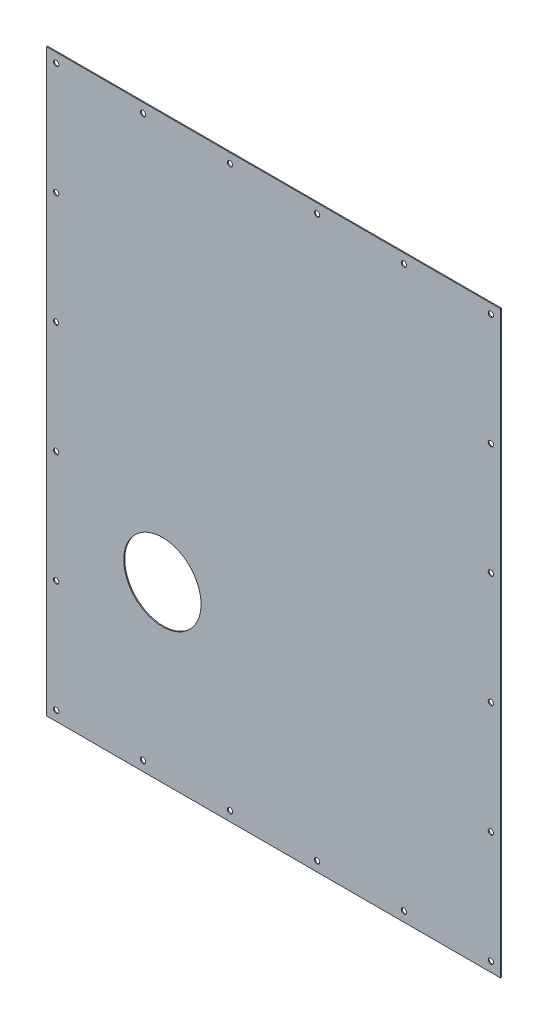
ISO-10303-21;
HEADER;
FILE_DESCRIPTION(('STEP AP214'),'2;1');
FILE_NAME('part.step','',(''),(''),'','','');
FILE_SCHEMA(('AUTOMOTIVE_DESIGN { 1 0 10303 214 1 1 1 1 }'));
ENDSEC;
DATA;
#1=APPLICATION_CONTEXT('core data for automotive mechanical design processes');
#2=APPLICATION_PROTOCOL_DEFINITION('international standard','automotive_design',2000,#1);
#3=PRODUCT_CONTEXT('',#1,'mechanical');
#4=PRODUCT('Part','Part','',(#3));
#5=PRODUCT_RELATED_PRODUCT_CATEGORY('part','',(#4));
#6=PRODUCT_DEFINITION_FORMATION('','',#4);
#7=PRODUCT_DEFINITION_CONTEXT('part definition',#1,'design');
#8=PRODUCT_DEFINITION('design','',#6,#7);
#9=PRODUCT_DEFINITION_SHAPE('','',#8);
#10=(LENGTH_UNIT() NAMED_UNIT(*) SI_UNIT(.MILLI.,.METRE.));
#11=(NAMED_UNIT(*) PLANE_ANGLE_UNIT() SI_UNIT($,.RADIAN.));
#12=(NAMED_UNIT(*) SI_UNIT($,.STERADIAN.) SOLID_ANGLE_UNIT());
#13=UNCERTAINTY_MEASURE_WITH_UNIT(LENGTH_MEASURE(1.E-05),#10,'distance_accuracy_value','');
#14=(GEOMETRIC_REPRESENTATION_CONTEXT(3) GLOBAL_UNCERTAINTY_ASSIGNED_CONTEXT((#13)) GLOBAL_UNIT_ASSIGNED_CONTEXT((#10,
#11,#12)) REPRESENTATION_CONTEXT('',''));
#15=CARTESIAN_POINT('',(0.,0.,0.));
#16=DIRECTION('',(0.,0.,1.));
#17=DIRECTION('',(1.,0.,0.));
#18=AXIS2_PLACEMENT_3D('',#15,#16,#17);
#19=CARTESIAN_POINT('',(-235.,-300.,1.));
#20=DIRECTION('',(-1.,0.,0.));
#21=DIRECTION('',(0.,0.,1.));
#22=AXIS2_PLACEMENT_3D('',#19,#20,#21);
#23=PLANE('',#22);
#24=DIRECTION('',(0.,1.,0.));
#25=VECTOR('',#24,1.);
#26=CARTESIAN_POINT('',(-235.,-300.,0.));
#27=LINE('',#26,#25);
#28=CARTESIAN_POINT('',(-235.,-300.,0.));
#29=VERTEX_POINT('',#28);
#30=CARTESIAN_POINT('',(-235.,300.,0.));
#31=VERTEX_POINT('',#30);
#32=EDGE_CURVE('E103',#29,#31,#27,.T.);
#33=ORIENTED_EDGE('',*,*,#32,.F.);
#34=DIRECTION('',(0.,0.,-1.));
#35=VECTOR('',#34,1.);
#36=CARTESIAN_POINT('',(-235.,-300.,1.));
#37=LINE('',#36,#35);
#38=CARTESIAN_POINT('',(-235.,-300.,1.));
#39=VERTEX_POINT('',#38);
#40=EDGE_CURVE('E11',#39,#29,#37,.T.);
#41=ORIENTED_EDGE('',*,*,#40,.F.);
#42=DIRECTION('',(0.,1.,0.));
#43=VECTOR('',#42,1.);
#44=CARTESIAN_POINT('',(-235.,-300.,1.));
#45=LINE('',#44,#43);
#46=CARTESIAN_POINT('',(-235.,300.,1.));
#47=VERTEX_POINT('',#46);
#48=EDGE_CURVE('E97',#39,#47,#45,.T.);
#49=ORIENTED_EDGE('',*,*,#48,.T.);
#50=DIRECTION('',(0.,0.,-1.));
#51=VECTOR('',#50,1.);
#52=CARTESIAN_POINT('',(-235.,300.,1.));
#53=LINE('',#52,#51);
#54=EDGE_CURVE('E40',#47,#31,#53,.T.);
#55=ORIENTED_EDGE('',*,*,#54,.T.);
#56=EDGE_LOOP('',(#33,#41,#49,#55));
#57=FACE_BOUND('',#56,.T.);
#58=ADVANCED_FACE('F37',(#57),#23,.T.);
#59=CARTESIAN_POINT('',(-235.,-300.,1.));
#60=DIRECTION('',(0.,1.,0.));
#61=DIRECTION('',(0.,0.,1.));
#62=AXIS2_PLACEMENT_3D('',#59,#60,#61);
#63=PLANE('',#62);
#64=DIRECTION('',(1.,0.,0.));
#65=VECTOR('',#64,1.);
#66=CARTESIAN_POINT('',(-235.,-300.,0.));
#67=LINE('',#66,#65);
#68=CARTESIAN_POINT('',(235.,-300.,0.));
#69=VERTEX_POINT('',#68);
#70=EDGE_CURVE('E70',#29,#69,#67,.T.);
#71=ORIENTED_EDGE('',*,*,#70,.T.);
#72=DIRECTION('',(0.,0.,-1.));
#73=VECTOR('',#72,1.);
#74=CARTESIAN_POINT('',(235.,-300.,1.));
#75=LINE('',#74,#73);
#76=CARTESIAN_POINT('',(235.,-300.,1.));
#77=VERTEX_POINT('',#76);
#78=EDGE_CURVE('E46',#77,#69,#75,.T.);
#79=ORIENTED_EDGE('',*,*,#78,.F.);
#80=DIRECTION('',(1.,0.,0.));
#81=VECTOR('',#80,1.);
#82=CARTESIAN_POINT('',(-235.,-300.,1.));
#83=LINE('',#82,#81);
#84=EDGE_CURVE('E87',#39,#77,#83,.T.);
#85=ORIENTED_EDGE('',*,*,#84,.F.);
#86=ORIENTED_EDGE('',*,*,#40,.T.);
#87=EDGE_LOOP('',(#71,#79,#85,#86));
#88=FACE_BOUND('',#87,.T.);
#89=ADVANCED_FACE('F114',(#88),#63,.F.);
#90=CARTESIAN_POINT('',(235.,-300.,1.));
#91=DIRECTION('',(-1.,0.,0.));
#92=DIRECTION('',(0.,0.,1.));
#93=AXIS2_PLACEMENT_3D('',#90,#91,#92);
#94=PLANE('',#93);
#95=DIRECTION('',(0.,1.,0.));
#96=VECTOR('',#95,1.);
#97=CARTESIAN_POINT('',(235.,-300.,0.));
#98=LINE('',#97,#96);
#99=CARTESIAN_POINT('',(235.,300.,0.));
#100=VERTEX_POINT('',#99);
#101=EDGE_CURVE('E94',#69,#100,#98,.T.);
#102=ORIENTED_EDGE('',*,*,#101,.T.);
#103=DIRECTION('',(0.,0.,-1.));
#104=VECTOR('',#103,1.);
#105=CARTESIAN_POINT('',(235.,300.,1.));
#106=LINE('',#105,#104);
#107=CARTESIAN_POINT('',(235.,300.,1.));
#108=VERTEX_POINT('',#107);
#109=EDGE_CURVE('E91',#108,#100,#106,.T.);
#110=ORIENTED_EDGE('',*,*,#109,.F.);
#111=DIRECTION('',(0.,1.,0.));
#112=VECTOR('',#111,1.);
#113=CARTESIAN_POINT('',(235.,-300.,1.));
#114=LINE('',#113,#112);
#115=EDGE_CURVE('E82',#77,#108,#114,.T.);
#116=ORIENTED_EDGE('',*,*,#115,.F.);
#117=ORIENTED_EDGE('',*,*,#78,.T.);
#118=EDGE_LOOP('',(#102,#110,#116,#117));
#119=FACE_BOUND('',#118,.T.);
#120=ADVANCED_FACE('F92',(#119),#94,.F.);
#121=CARTESIAN_POINT('',(-235.,300.,1.));
#122=DIRECTION('',(0.,1.,0.));
#123=DIRECTION('',(0.,0.,1.));
#124=AXIS2_PLACEMENT_3D('',#121,#122,#123);
#125=PLANE('',#124);
#126=DIRECTION('',(1.,0.,0.));
#127=VECTOR('',#126,1.);
#128=CARTESIAN_POINT('',(-235.,300.,0.));
#129=LINE('',#128,#127);
#130=EDGE_CURVE('E106',#31,#100,#129,.T.);
#131=ORIENTED_EDGE('',*,*,#130,.F.);
#132=ORIENTED_EDGE('',*,*,#54,.F.);
#133=DIRECTION('',(1.,0.,0.));
#134=VECTOR('',#133,1.);
#135=CARTESIAN_POINT('',(-235.,300.,1.));
#136=LINE('',#135,#134);
#137=EDGE_CURVE('E86',#47,#108,#136,.T.);
#138=ORIENTED_EDGE('',*,*,#137,.T.);
#139=ORIENTED_EDGE('',*,*,#109,.T.);
#140=EDGE_LOOP('',(#131,#132,#138,#139));
#141=FACE_BOUND('',#140,.T.);
#142=ADVANCED_FACE('F96',(#141),#125,.T.);
#143=CARTESIAN_POINT('',(0.,0.,1.));
#144=DIRECTION('',(0.,0.,-1.));
#145=DIRECTION('',(-1.,0.,0.));
#146=AXIS2_PLACEMENT_3D('',#143,#144,#145);
#147=PLANE('',#146);
#148=CARTESIAN_POINT('',(-115.,-120.,0.999999999999999));
#149=DIRECTION('',(0.,0.,-1.));
#150=DIRECTION('',(-1.,0.,0.));
#151=AXIS2_PLACEMENT_3D('',#148,#149,#150);
#152=CIRCLE('',#151,40.);
#153=CARTESIAN_POINT('',(-155.,-120.,0.999999999999999));
#154=VERTEX_POINT('',#153);
#155=EDGE_CURVE('E227',#154,#154,#152,.T.);
#156=ORIENTED_EDGE('',*,*,#155,.T.);
#157=EDGE_LOOP('',(#156));
#158=FACE_BOUND('',#157,.T.);
#159=CARTESIAN_POINT('',(225.,290.,1.));
#160=DIRECTION('',(0.,0.,-1.));
#161=DIRECTION('',(-1.,0.,0.));
#162=AXIS2_PLACEMENT_3D('',#159,#160,#161);
#163=CIRCLE('',#162,2.75);
#164=CARTESIAN_POINT('',(222.25,290.,1.));
#165=VERTEX_POINT('',#164);
#166=EDGE_CURVE('E231',#165,#165,#163,.T.);
#167=ORIENTED_EDGE('',*,*,#166,.T.);
#168=EDGE_LOOP('',(#167));
#169=FACE_BOUND('',#168,.T.);
#170=CARTESIAN_POINT('',(135.,290.,1.));
#171=DIRECTION('',(0.,0.,-1.));
#172=DIRECTION('',(-1.,0.,0.));
#173=AXIS2_PLACEMENT_3D('',#170,#171,#172);
#174=CIRCLE('',#173,2.75);
#175=CARTESIAN_POINT('',(132.25,290.,1.));
#176=VERTEX_POINT('',#175);
#177=EDGE_CURVE('E240',#176,#176,#174,.T.);
#178=ORIENTED_EDGE('',*,*,#177,.T.);
#179=EDGE_LOOP('',(#178));
#180=FACE_BOUND('',#179,.T.);
#181=CARTESIAN_POINT('',(45.,290.,1.));
#182=DIRECTION('',(0.,0.,-1.));
#183=DIRECTION('',(-1.,0.,0.));
#184=AXIS2_PLACEMENT_3D('',#181,#182,#183);
#185=CIRCLE('',#184,2.75);
#186=CARTESIAN_POINT('',(42.25,290.,1.));
#187=VERTEX_POINT('',#186);
#188=EDGE_CURVE('E246',#187,#187,#185,.T.);
#189=ORIENTED_EDGE('',*,*,#188,.T.);
#190=EDGE_LOOP('',(#189));
#191=FACE_BOUND('',#190,.T.);
#192=CARTESIAN_POINT('',(-45.,290.,1.));
#193=DIRECTION('',(0.,0.,-1.));
#194=DIRECTION('',(-1.,0.,0.));
#195=AXIS2_PLACEMENT_3D('',#192,#193,#194);
#196=CIRCLE('',#195,2.75);
#197=CARTESIAN_POINT('',(-47.75,290.,1.));
#198=VERTEX_POINT('',#197);
#199=EDGE_CURVE('E252',#198,#198,#196,.T.);
#200=ORIENTED_EDGE('',*,*,#199,.T.);
#201=EDGE_LOOP('',(#200));
#202=FACE_BOUND('',#201,.T.);
#203=CARTESIAN_POINT('',(-135.,290.,1.));
#204=DIRECTION('',(0.,0.,-1.));
#205=DIRECTION('',(-1.,0.,0.));
#206=AXIS2_PLACEMENT_3D('',#203,#204,#205);
#207=CIRCLE('',#206,2.75);
#208=CARTESIAN_POINT('',(-137.75,290.,1.));
#209=VERTEX_POINT('',#208);
#210=EDGE_CURVE('E258',#209,#209,#207,.T.);
#211=ORIENTED_EDGE('',*,*,#210,.T.);
#212=EDGE_LOOP('',(#211));
#213=FACE_BOUND('',#212,.T.);
#214=CARTESIAN_POINT('',(-225.,290.,1.));
#215=DIRECTION('',(0.,0.,-1.));
#216=DIRECTION('',(-1.,0.,0.));
#217=AXIS2_PLACEMENT_3D('',#214,#215,#216);
#218=CIRCLE('',#217,2.75);
#219=CARTESIAN_POINT('',(-227.75,290.,1.));
#220=VERTEX_POINT('',#219);
#221=EDGE_CURVE('E264',#220,#220,#218,.T.);
#222=ORIENTED_EDGE('',*,*,#221,.T.);
#223=EDGE_LOOP('',(#222));
#224=FACE_BOUND('',#223,.T.);
#225=CARTESIAN_POINT('',(-225.,174.,1.));
#226=DIRECTION('',(0.,0.,-1.));
#227=DIRECTION('',(-1.,0.,0.));
#228=AXIS2_PLACEMENT_3D('',#225,#226,#227);
#229=CIRCLE('',#228,2.75);
#230=CARTESIAN_POINT('',(-227.75,174.,1.));
#231=VERTEX_POINT('',#230);
#232=EDGE_CURVE('E270',#231,#231,#229,.T.);
#233=ORIENTED_EDGE('',*,*,#232,.T.);
#234=EDGE_LOOP('',(#233));
#235=FACE_BOUND('',#234,.T.);
#236=CARTESIAN_POINT('',(-225.,57.9999999999999,1.));
#237=DIRECTION('',(0.,0.,-1.));
#238=DIRECTION('',(-1.,0.,0.));
#239=AXIS2_PLACEMENT_3D('',#236,#237,#238);
#240=CIRCLE('',#239,2.75);
#241=CARTESIAN_POINT('',(-227.75,57.9999999999999,1.));
#242=VERTEX_POINT('',#241);
#243=EDGE_CURVE('E276',#242,#242,#240,.T.);
#244=ORIENTED_EDGE('',*,*,#243,.T.);
#245=EDGE_LOOP('',(#244));
#246=FACE_BOUND('',#245,.T.);
#247=CARTESIAN_POINT('',(-225.,-58.0000000000001,1.));
#248=DIRECTION('',(0.,0.,-1.));
#249=DIRECTION('',(-1.,0.,0.));
#250=AXIS2_PLACEMENT_3D('',#247,#248,#249);
#251=CIRCLE('',#250,2.75);
#252=CARTESIAN_POINT('',(-227.75,-58.0000000000001,1.));
#253=VERTEX_POINT('',#252);
#254=EDGE_CURVE('E282',#253,#253,#251,.T.);
#255=ORIENTED_EDGE('',*,*,#254,.T.);
#256=EDGE_LOOP('',(#255));
#257=FACE_BOUND('',#256,.T.);
#258=CARTESIAN_POINT('',(-225.,-174.,1.));
#259=DIRECTION('',(0.,0.,-1.));
#260=DIRECTION('',(-1.,0.,0.));
#261=AXIS2_PLACEMENT_3D('',#258,#259,#260);
#262=CIRCLE('',#261,2.75);
#263=CARTESIAN_POINT('',(-227.75,-174.,1.));
#264=VERTEX_POINT('',#263);
#265=EDGE_CURVE('E288',#264,#264,#262,.T.);
#266=ORIENTED_EDGE('',*,*,#265,.T.);
#267=EDGE_LOOP('',(#266));
#268=FACE_BOUND('',#267,.T.);
#269=CARTESIAN_POINT('',(-225.,-290.,1.));
#270=DIRECTION('',(0.,0.,-1.));
#271=DIRECTION('',(-1.,0.,0.));
#272=AXIS2_PLACEMENT_3D('',#269,#270,#271);
#273=CIRCLE('',#272,2.75);
#274=CARTESIAN_POINT('',(-227.75,-290.,1.));
#275=VERTEX_POINT('',#274);
#276=EDGE_CURVE('E294',#275,#275,#273,.T.);
#277=ORIENTED_EDGE('',*,*,#276,.T.);
#278=EDGE_LOOP('',(#277));
#279=FACE_BOUND('',#278,.T.);
#280=CARTESIAN_POINT('',(225.,174.,1.));
#281=DIRECTION('',(0.,0.,-1.));
#282=DIRECTION('',(-1.,0.,0.));
#283=AXIS2_PLACEMENT_3D('',#280,#281,#282);
#284=CIRCLE('',#283,2.75);
#285=CARTESIAN_POINT('',(222.25,174.,1.));
#286=VERTEX_POINT('',#285);
#287=EDGE_CURVE('E300',#286,#286,#284,.T.);
#288=ORIENTED_EDGE('',*,*,#287,.T.);
#289=EDGE_LOOP('',(#288));
#290=FACE_BOUND('',#289,.T.);
#291=CARTESIAN_POINT('',(225.,57.9999999999999,1.));
#292=DIRECTION('',(0.,0.,-1.));
#293=DIRECTION('',(-1.,0.,0.));
#294=AXIS2_PLACEMENT_3D('',#291,#292,#293);
#295=CIRCLE('',#294,2.75);
#296=CARTESIAN_POINT('',(222.25,57.9999999999999,1.));
#297=VERTEX_POINT('',#296);
#298=EDGE_CURVE('E306',#297,#297,#295,.T.);
#299=ORIENTED_EDGE('',*,*,#298,.T.);
#300=EDGE_LOOP('',(#299));
#301=FACE_BOUND('',#300,.T.);
#302=CARTESIAN_POINT('',(225.,-58.0000000000001,1.));
#303=DIRECTION('',(0.,0.,-1.));
#304=DIRECTION('',(-1.,0.,0.));
#305=AXIS2_PLACEMENT_3D('',#302,#303,#304);
#306=CIRCLE('',#305,2.75);
#307=CARTESIAN_POINT('',(222.25,-58.0000000000001,1.));
#308=VERTEX_POINT('',#307);
#309=EDGE_CURVE('E312',#308,#308,#306,.T.);
#310=ORIENTED_EDGE('',*,*,#309,.T.);
#311=EDGE_LOOP('',(#310));
#312=FACE_BOUND('',#311,.T.);
#313=CARTESIAN_POINT('',(225.,-174.,1.));
#314=DIRECTION('',(0.,0.,-1.));
#315=DIRECTION('',(-1.,0.,0.));
#316=AXIS2_PLACEMENT_3D('',#313,#314,#315);
#317=CIRCLE('',#316,2.75);
#318=CARTESIAN_POINT('',(222.25,-174.,1.));
#319=VERTEX_POINT('',#318);
#320=EDGE_CURVE('E318',#319,#319,#317,.T.);
#321=ORIENTED_EDGE('',*,*,#320,.T.);
#322=EDGE_LOOP('',(#321));
#323=FACE_BOUND('',#322,.T.);
#324=CARTESIAN_POINT('',(225.,-290.,1.));
#325=DIRECTION('',(0.,0.,-1.));
#326=DIRECTION('',(-1.,0.,0.));
#327=AXIS2_PLACEMENT_3D('',#324,#325,#326);
#328=CIRCLE('',#327,2.75);
#329=CARTESIAN_POINT('',(222.25,-290.,1.));
#330=VERTEX_POINT('',#329);
#331=EDGE_CURVE('E324',#330,#330,#328,.T.);
#332=ORIENTED_EDGE('',*,*,#331,.T.);
#333=EDGE_LOOP('',(#332));
#334=FACE_BOUND('',#333,.T.);
#335=CARTESIAN_POINT('',(135.,-290.,1.));
#336=DIRECTION('',(0.,0.,-1.));
#337=DIRECTION('',(-1.,0.,0.));
#338=AXIS2_PLACEMENT_3D('',#335,#336,#337);
#339=CIRCLE('',#338,2.75);
#340=CARTESIAN_POINT('',(132.25,-290.,1.));
#341=VERTEX_POINT('',#340);
#342=EDGE_CURVE('E330',#341,#341,#339,.T.);
#343=ORIENTED_EDGE('',*,*,#342,.T.);
#344=EDGE_LOOP('',(#343));
#345=FACE_BOUND('',#344,.T.);
#346=CARTESIAN_POINT('',(45.,-290.,1.));
#347=DIRECTION('',(0.,0.,-1.));
#348=DIRECTION('',(-1.,0.,0.));
#349=AXIS2_PLACEMENT_3D('',#346,#347,#348);
#350=CIRCLE('',#349,2.75);
#351=CARTESIAN_POINT('',(42.25,-290.,1.));
#352=VERTEX_POINT('',#351);
#353=EDGE_CURVE('E336',#352,#352,#350,.T.);
#354=ORIENTED_EDGE('',*,*,#353,.T.);
#355=EDGE_LOOP('',(#354));
#356=FACE_BOUND('',#355,.T.);
#357=CARTESIAN_POINT('',(-45.,-290.,1.));
#358=DIRECTION('',(0.,0.,-1.));
#359=DIRECTION('',(-1.,0.,0.));
#360=AXIS2_PLACEMENT_3D('',#357,#358,#359);
#361=CIRCLE('',#360,2.75);
#362=CARTESIAN_POINT('',(-47.75,-290.,1.));
#363=VERTEX_POINT('',#362);
#364=EDGE_CURVE('E342',#363,#363,#361,.T.);
#365=ORIENTED_EDGE('',*,*,#364,.T.);
#366=EDGE_LOOP('',(#365));
#367=FACE_BOUND('',#366,.T.);
#368=CARTESIAN_POINT('',(-135.,-290.,1.));
#369=DIRECTION('',(0.,0.,-1.));
#370=DIRECTION('',(-1.,0.,0.));
#371=AXIS2_PLACEMENT_3D('',#368,#369,#370);
#372=CIRCLE('',#371,2.75);
#373=CARTESIAN_POINT('',(-137.75,-290.,1.));
#374=VERTEX_POINT('',#373);
#375=EDGE_CURVE('E107',#374,#374,#372,.T.);
#376=ORIENTED_EDGE('',*,*,#375,.T.);
#377=EDGE_LOOP('',(#376));
#378=FACE_BOUND('',#377,.T.);
#379=ORIENTED_EDGE('',*,*,#48,.F.);
#380=ORIENTED_EDGE('',*,*,#84,.T.);
#381=ORIENTED_EDGE('',*,*,#115,.T.);
#382=ORIENTED_EDGE('',*,*,#137,.F.);
#383=EDGE_LOOP('',(#379,#380,#381,#382));
#384=FACE_BOUND('',#383,.T.);
#385=ADVANCED_FACE('F85',(#158,#169,#180,#191,#202,#213,#224,#235,#246,#257,#268,#279,#290,#301,
#312,#323,#334,#345,#356,#367,#378,#384),#147,.F.);
#386=CARTESIAN_POINT('',(0.,0.,0.));
#387=DIRECTION('',(0.,0.,-1.));
#388=DIRECTION('',(-1.,0.,0.));
#389=AXIS2_PLACEMENT_3D('',#386,#387,#388);
#390=PLANE('',#389);
#391=CARTESIAN_POINT('',(-115.,-120.,0.));
#392=DIRECTION('',(0.,0.,-1.));
#393=DIRECTION('',(-1.,0.,0.));
#394=AXIS2_PLACEMENT_3D('',#391,#392,#393);
#395=CIRCLE('',#394,40.);
#396=CARTESIAN_POINT('',(-155.,-120.,0.));
#397=VERTEX_POINT('',#396);
#398=EDGE_CURVE('E225',#397,#397,#395,.T.);
#399=ORIENTED_EDGE('',*,*,#398,.F.);
#400=EDGE_LOOP('',(#399));
#401=FACE_BOUND('',#400,.T.);
#402=CARTESIAN_POINT('',(225.,290.,0.));
#403=DIRECTION('',(0.,0.,-1.));
#404=DIRECTION('',(-1.,0.,0.));
#405=AXIS2_PLACEMENT_3D('',#402,#403,#404);
#406=CIRCLE('',#405,2.75);
#407=CARTESIAN_POINT('',(222.25,290.,0.));
#408=VERTEX_POINT('',#407);
#409=EDGE_CURVE('E228',#408,#408,#406,.T.);
#410=ORIENTED_EDGE('',*,*,#409,.F.);
#411=EDGE_LOOP('',(#410));
#412=FACE_BOUND('',#411,.T.);
#413=CARTESIAN_POINT('',(135.,290.,0.));
#414=DIRECTION('',(0.,0.,-1.));
#415=DIRECTION('',(-1.,0.,0.));
#416=AXIS2_PLACEMENT_3D('',#413,#414,#415);
#417=CIRCLE('',#416,2.75);
#418=CARTESIAN_POINT('',(132.25,290.,0.));
#419=VERTEX_POINT('',#418);
#420=EDGE_CURVE('E237',#419,#419,#417,.T.);
#421=ORIENTED_EDGE('',*,*,#420,.F.);
#422=EDGE_LOOP('',(#421));
#423=FACE_BOUND('',#422,.T.);
#424=CARTESIAN_POINT('',(45.,290.,0.));
#425=DIRECTION('',(0.,0.,-1.));
#426=DIRECTION('',(-1.,0.,0.));
#427=AXIS2_PLACEMENT_3D('',#424,#425,#426);
#428=CIRCLE('',#427,2.75);
#429=CARTESIAN_POINT('',(42.25,290.,0.));
#430=VERTEX_POINT('',#429);
#431=EDGE_CURVE('E243',#430,#430,#428,.T.);
#432=ORIENTED_EDGE('',*,*,#431,.F.);
#433=EDGE_LOOP('',(#432));
#434=FACE_BOUND('',#433,.T.);
#435=CARTESIAN_POINT('',(-45.,290.,0.));
#436=DIRECTION('',(0.,0.,-1.));
#437=DIRECTION('',(-1.,0.,0.));
#438=AXIS2_PLACEMENT_3D('',#435,#436,#437);
#439=CIRCLE('',#438,2.75);
#440=CARTESIAN_POINT('',(-47.75,290.,0.));
#441=VERTEX_POINT('',#440);
#442=EDGE_CURVE('E249',#441,#441,#439,.T.);
#443=ORIENTED_EDGE('',*,*,#442,.F.);
#444=EDGE_LOOP('',(#443));
#445=FACE_BOUND('',#444,.T.);
#446=CARTESIAN_POINT('',(-135.,290.,0.));
#447=DIRECTION('',(0.,0.,-1.));
#448=DIRECTION('',(-1.,0.,0.));
#449=AXIS2_PLACEMENT_3D('',#446,#447,#448);
#450=CIRCLE('',#449,2.75);
#451=CARTESIAN_POINT('',(-137.75,290.,0.));
#452=VERTEX_POINT('',#451);
#453=EDGE_CURVE('E255',#452,#452,#450,.T.);
#454=ORIENTED_EDGE('',*,*,#453,.F.);
#455=EDGE_LOOP('',(#454));
#456=FACE_BOUND('',#455,.T.);
#457=CARTESIAN_POINT('',(-225.,290.,0.));
#458=DIRECTION('',(0.,0.,-1.));
#459=DIRECTION('',(-1.,0.,0.));
#460=AXIS2_PLACEMENT_3D('',#457,#458,#459);
#461=CIRCLE('',#460,2.75);
#462=CARTESIAN_POINT('',(-227.75,290.,0.));
#463=VERTEX_POINT('',#462);
#464=EDGE_CURVE('E261',#463,#463,#461,.T.);
#465=ORIENTED_EDGE('',*,*,#464,.F.);
#466=EDGE_LOOP('',(#465));
#467=FACE_BOUND('',#466,.T.);
#468=CARTESIAN_POINT('',(-225.,174.,0.));
#469=DIRECTION('',(0.,0.,-1.));
#470=DIRECTION('',(-1.,0.,0.));
#471=AXIS2_PLACEMENT_3D('',#468,#469,#470);
#472=CIRCLE('',#471,2.75);
#473=CARTESIAN_POINT('',(-227.75,174.,0.));
#474=VERTEX_POINT('',#473);
#475=EDGE_CURVE('E267',#474,#474,#472,.T.);
#476=ORIENTED_EDGE('',*,*,#475,.F.);
#477=EDGE_LOOP('',(#476));
#478=FACE_BOUND('',#477,.T.);
#479=CARTESIAN_POINT('',(-225.,57.9999999999999,0.));
#480=DIRECTION('',(0.,0.,-1.));
#481=DIRECTION('',(-1.,0.,0.));
#482=AXIS2_PLACEMENT_3D('',#479,#480,#481);
#483=CIRCLE('',#482,2.75);
#484=CARTESIAN_POINT('',(-227.75,57.9999999999999,0.));
#485=VERTEX_POINT('',#484);
#486=EDGE_CURVE('E273',#485,#485,#483,.T.);
#487=ORIENTED_EDGE('',*,*,#486,.F.);
#488=EDGE_LOOP('',(#487));
#489=FACE_BOUND('',#488,.T.);
#490=CARTESIAN_POINT('',(-225.,-58.0000000000001,0.));
#491=DIRECTION('',(0.,0.,-1.));
#492=DIRECTION('',(-1.,0.,0.));
#493=AXIS2_PLACEMENT_3D('',#490,#491,#492);
#494=CIRCLE('',#493,2.75);
#495=CARTESIAN_POINT('',(-227.75,-58.0000000000001,0.));
#496=VERTEX_POINT('',#495);
#497=EDGE_CURVE('E279',#496,#496,#494,.T.);
#498=ORIENTED_EDGE('',*,*,#497,.F.);
#499=EDGE_LOOP('',(#498));
#500=FACE_BOUND('',#499,.T.);
#501=CARTESIAN_POINT('',(-225.,-174.,0.));
#502=DIRECTION('',(0.,0.,-1.));
#503=DIRECTION('',(-1.,0.,0.));
#504=AXIS2_PLACEMENT_3D('',#501,#502,#503);
#505=CIRCLE('',#504,2.75);
#506=CARTESIAN_POINT('',(-227.75,-174.,0.));
#507=VERTEX_POINT('',#506);
#508=EDGE_CURVE('E285',#507,#507,#505,.T.);
#509=ORIENTED_EDGE('',*,*,#508,.F.);
#510=EDGE_LOOP('',(#509));
#511=FACE_BOUND('',#510,.T.);
#512=CARTESIAN_POINT('',(-225.,-290.,0.));
#513=DIRECTION('',(0.,0.,-1.));
#514=DIRECTION('',(-1.,0.,0.));
#515=AXIS2_PLACEMENT_3D('',#512,#513,#514);
#516=CIRCLE('',#515,2.75);
#517=CARTESIAN_POINT('',(-227.75,-290.,0.));
#518=VERTEX_POINT('',#517);
#519=EDGE_CURVE('E291',#518,#518,#516,.T.);
#520=ORIENTED_EDGE('',*,*,#519,.F.);
#521=EDGE_LOOP('',(#520));
#522=FACE_BOUND('',#521,.T.);
#523=CARTESIAN_POINT('',(225.,174.,0.));
#524=DIRECTION('',(0.,0.,-1.));
#525=DIRECTION('',(-1.,0.,0.));
#526=AXIS2_PLACEMENT_3D('',#523,#524,#525);
#527=CIRCLE('',#526,2.75);
#528=CARTESIAN_POINT('',(222.25,174.,0.));
#529=VERTEX_POINT('',#528);
#530=EDGE_CURVE('E297',#529,#529,#527,.T.);
#531=ORIENTED_EDGE('',*,*,#530,.F.);
#532=EDGE_LOOP('',(#531));
#533=FACE_BOUND('',#532,.T.);
#534=CARTESIAN_POINT('',(225.,57.9999999999999,0.));
#535=DIRECTION('',(0.,0.,-1.));
#536=DIRECTION('',(-1.,0.,0.));
#537=AXIS2_PLACEMENT_3D('',#534,#535,#536);
#538=CIRCLE('',#537,2.75);
#539=CARTESIAN_POINT('',(222.25,57.9999999999999,0.));
#540=VERTEX_POINT('',#539);
#541=EDGE_CURVE('E303',#540,#540,#538,.T.);
#542=ORIENTED_EDGE('',*,*,#541,.F.);
#543=EDGE_LOOP('',(#542));
#544=FACE_BOUND('',#543,.T.);
#545=CARTESIAN_POINT('',(225.,-58.0000000000001,0.));
#546=DIRECTION('',(0.,0.,-1.));
#547=DIRECTION('',(-1.,0.,0.));
#548=AXIS2_PLACEMENT_3D('',#545,#546,#547);
#549=CIRCLE('',#548,2.75);
#550=CARTESIAN_POINT('',(222.25,-58.0000000000001,0.));
#551=VERTEX_POINT('',#550);
#552=EDGE_CURVE('E309',#551,#551,#549,.T.);
#553=ORIENTED_EDGE('',*,*,#552,.F.);
#554=EDGE_LOOP('',(#553));
#555=FACE_BOUND('',#554,.T.);
#556=CARTESIAN_POINT('',(225.,-174.,0.));
#557=DIRECTION('',(0.,0.,-1.));
#558=DIRECTION('',(-1.,0.,0.));
#559=AXIS2_PLACEMENT_3D('',#556,#557,#558);
#560=CIRCLE('',#559,2.75);
#561=CARTESIAN_POINT('',(222.25,-174.,0.));
#562=VERTEX_POINT('',#561);
#563=EDGE_CURVE('E315',#562,#562,#560,.T.);
#564=ORIENTED_EDGE('',*,*,#563,.F.);
#565=EDGE_LOOP('',(#564));
#566=FACE_BOUND('',#565,.T.);
#567=CARTESIAN_POINT('',(225.,-290.,0.));
#568=DIRECTION('',(0.,0.,-1.));
#569=DIRECTION('',(-1.,0.,0.));
#570=AXIS2_PLACEMENT_3D('',#567,#568,#569);
#571=CIRCLE('',#570,2.75);
#572=CARTESIAN_POINT('',(222.25,-290.,0.));
#573=VERTEX_POINT('',#572);
#574=EDGE_CURVE('E321',#573,#573,#571,.T.);
#575=ORIENTED_EDGE('',*,*,#574,.F.);
#576=EDGE_LOOP('',(#575));
#577=FACE_BOUND('',#576,.T.);
#578=CARTESIAN_POINT('',(135.,-290.,0.));
#579=DIRECTION('',(0.,0.,-1.));
#580=DIRECTION('',(-1.,0.,0.));
#581=AXIS2_PLACEMENT_3D('',#578,#579,#580);
#582=CIRCLE('',#581,2.75);
#583=CARTESIAN_POINT('',(132.25,-290.,0.));
#584=VERTEX_POINT('',#583);
#585=EDGE_CURVE('E327',#584,#584,#582,.T.);
#586=ORIENTED_EDGE('',*,*,#585,.F.);
#587=EDGE_LOOP('',(#586));
#588=FACE_BOUND('',#587,.T.);
#589=CARTESIAN_POINT('',(45.,-290.,0.));
#590=DIRECTION('',(0.,0.,-1.));
#591=DIRECTION('',(-1.,0.,0.));
#592=AXIS2_PLACEMENT_3D('',#589,#590,#591);
#593=CIRCLE('',#592,2.75);
#594=CARTESIAN_POINT('',(42.25,-290.,0.));
#595=VERTEX_POINT('',#594);
#596=EDGE_CURVE('E333',#595,#595,#593,.T.);
#597=ORIENTED_EDGE('',*,*,#596,.F.);
#598=EDGE_LOOP('',(#597));
#599=FACE_BOUND('',#598,.T.);
#600=CARTESIAN_POINT('',(-45.,-290.,0.));
#601=DIRECTION('',(0.,0.,-1.));
#602=DIRECTION('',(-1.,0.,0.));
#603=AXIS2_PLACEMENT_3D('',#600,#601,#602);
#604=CIRCLE('',#603,2.75);
#605=CARTESIAN_POINT('',(-47.75,-290.,0.));
#606=VERTEX_POINT('',#605);
#607=EDGE_CURVE('E339',#606,#606,#604,.T.);
#608=ORIENTED_EDGE('',*,*,#607,.F.);
#609=EDGE_LOOP('',(#608));
#610=FACE_BOUND('',#609,.T.);
#611=CARTESIAN_POINT('',(-135.,-290.,0.));
#612=DIRECTION('',(0.,0.,-1.));
#613=DIRECTION('',(-1.,0.,0.));
#614=AXIS2_PLACEMENT_3D('',#611,#612,#613);
#615=CIRCLE('',#614,2.75);
#616=CARTESIAN_POINT('',(-137.75,-290.,0.));
#617=VERTEX_POINT('',#616);
#618=EDGE_CURVE('E345',#617,#617,#615,.T.);
#619=ORIENTED_EDGE('',*,*,#618,.F.);
#620=EDGE_LOOP('',(#619));
#621=FACE_BOUND('',#620,.T.);
#622=ORIENTED_EDGE('',*,*,#32,.T.);
#623=ORIENTED_EDGE('',*,*,#130,.T.);
#624=ORIENTED_EDGE('',*,*,#101,.F.);
#625=ORIENTED_EDGE('',*,*,#70,.F.);
#626=EDGE_LOOP('',(#622,#623,#624,#625));
#627=FACE_BOUND('',#626,.T.);
#628=ADVANCED_FACE('F112',(#401,#412,#423,#434,#445,#456,#467,#478,#489,#500,#511,#522,#533,
#544,#555,#566,#577,#588,#599,#610,#621,#627),#390,.T.);
#629=CARTESIAN_POINT('',(-135.,-290.,0.));
#630=DIRECTION('',(0.,0.,-1.));
#631=DIRECTION('',(-1.,0.,0.));
#632=AXIS2_PLACEMENT_3D('',#629,#630,#631);
#633=CYLINDRICAL_SURFACE('',#632,2.75);
#634=ORIENTED_EDGE('',*,*,#375,.F.);
#635=EDGE_LOOP('',(#634));
#636=FACE_BOUND('',#635,.T.);
#637=ORIENTED_EDGE('',*,*,#618,.T.);
#638=EDGE_LOOP('',(#637));
#639=FACE_BOUND('',#638,.T.);
#640=ADVANCED_FACE('F133',(#636,#639),#633,.F.);
#641=CARTESIAN_POINT('',(-45.,-290.,0.));
#642=DIRECTION('',(0.,0.,-1.));
#643=DIRECTION('',(-1.,0.,0.));
#644=AXIS2_PLACEMENT_3D('',#641,#642,#643);
#645=CYLINDRICAL_SURFACE('',#644,2.75);
#646=ORIENTED_EDGE('',*,*,#364,.F.);
#647=EDGE_LOOP('',(#646));
#648=FACE_BOUND('',#647,.T.);
#649=ORIENTED_EDGE('',*,*,#607,.T.);
#650=EDGE_LOOP('',(#649));
#651=FACE_BOUND('',#650,.T.);
#652=ADVANCED_FACE('F140',(#648,#651),#645,.F.);
#653=CARTESIAN_POINT('',(45.,-290.,0.));
#654=DIRECTION('',(0.,0.,-1.));
#655=DIRECTION('',(-1.,0.,0.));
#656=AXIS2_PLACEMENT_3D('',#653,#654,#655);
#657=CYLINDRICAL_SURFACE('',#656,2.75);
#658=ORIENTED_EDGE('',*,*,#353,.F.);
#659=EDGE_LOOP('',(#658));
#660=FACE_BOUND('',#659,.T.);
#661=ORIENTED_EDGE('',*,*,#596,.T.);
#662=EDGE_LOOP('',(#661));
#663=FACE_BOUND('',#662,.T.);
#664=ADVANCED_FACE('F144',(#660,#663),#657,.F.);
#665=CARTESIAN_POINT('',(135.,-290.,0.));
#666=DIRECTION('',(0.,0.,-1.));
#667=DIRECTION('',(-1.,0.,0.));
#668=AXIS2_PLACEMENT_3D('',#665,#666,#667);
#669=CYLINDRICAL_SURFACE('',#668,2.75);
#670=ORIENTED_EDGE('',*,*,#342,.F.);
#671=EDGE_LOOP('',(#670));
#672=FACE_BOUND('',#671,.T.);
#673=ORIENTED_EDGE('',*,*,#585,.T.);
#674=EDGE_LOOP('',(#673));
#675=FACE_BOUND('',#674,.T.);
#676=ADVANCED_FACE('F148',(#672,#675),#669,.F.);
#677=CARTESIAN_POINT('',(225.,-290.,0.));
#678=DIRECTION('',(0.,0.,-1.));
#679=DIRECTION('',(-1.,0.,0.));
#680=AXIS2_PLACEMENT_3D('',#677,#678,#679);
#681=CYLINDRICAL_SURFACE('',#680,2.75);
#682=ORIENTED_EDGE('',*,*,#331,.F.);
#683=EDGE_LOOP('',(#682));
#684=FACE_BOUND('',#683,.T.);
#685=ORIENTED_EDGE('',*,*,#574,.T.);
#686=EDGE_LOOP('',(#685));
#687=FACE_BOUND('',#686,.T.);
#688=ADVANCED_FACE('F152',(#684,#687),#681,.F.);
#689=CARTESIAN_POINT('',(225.,-174.,0.));
#690=DIRECTION('',(0.,0.,-1.));
#691=DIRECTION('',(-1.,0.,0.));
#692=AXIS2_PLACEMENT_3D('',#689,#690,#691);
#693=CYLINDRICAL_SURFACE('',#692,2.75);
#694=ORIENTED_EDGE('',*,*,#320,.F.);
#695=EDGE_LOOP('',(#694));
#696=FACE_BOUND('',#695,.T.);
#697=ORIENTED_EDGE('',*,*,#563,.T.);
#698=EDGE_LOOP('',(#697));
#699=FACE_BOUND('',#698,.T.);
#700=ADVANCED_FACE('F156',(#696,#699),#693,.F.);
#701=CARTESIAN_POINT('',(225.,-58.0000000000001,0.));
#702=DIRECTION('',(0.,0.,-1.));
#703=DIRECTION('',(-1.,0.,0.));
#704=AXIS2_PLACEMENT_3D('',#701,#702,#703);
#705=CYLINDRICAL_SURFACE('',#704,2.75);
#706=ORIENTED_EDGE('',*,*,#309,.F.);
#707=EDGE_LOOP('',(#706));
#708=FACE_BOUND('',#707,.T.);
#709=ORIENTED_EDGE('',*,*,#552,.T.);
#710=EDGE_LOOP('',(#709));
#711=FACE_BOUND('',#710,.T.);
#712=ADVANCED_FACE('F160',(#708,#711),#705,.F.);
#713=CARTESIAN_POINT('',(225.,57.9999999999999,0.));
#714=DIRECTION('',(0.,0.,-1.));
#715=DIRECTION('',(-1.,0.,0.));
#716=AXIS2_PLACEMENT_3D('',#713,#714,#715);
#717=CYLINDRICAL_SURFACE('',#716,2.75);
#718=ORIENTED_EDGE('',*,*,#298,.F.);
#719=EDGE_LOOP('',(#718));
#720=FACE_BOUND('',#719,.T.);
#721=ORIENTED_EDGE('',*,*,#541,.T.);
#722=EDGE_LOOP('',(#721));
#723=FACE_BOUND('',#722,.T.);
#724=ADVANCED_FACE('F164',(#720,#723),#717,.F.);
#725=CARTESIAN_POINT('',(225.,174.,0.));
#726=DIRECTION('',(0.,0.,-1.));
#727=DIRECTION('',(-1.,0.,0.));
#728=AXIS2_PLACEMENT_3D('',#725,#726,#727);
#729=CYLINDRICAL_SURFACE('',#728,2.75);
#730=ORIENTED_EDGE('',*,*,#287,.F.);
#731=EDGE_LOOP('',(#730));
#732=FACE_BOUND('',#731,.T.);
#733=ORIENTED_EDGE('',*,*,#530,.T.);
#734=EDGE_LOOP('',(#733));
#735=FACE_BOUND('',#734,.T.);
#736=ADVANCED_FACE('F168',(#732,#735),#729,.F.);
#737=CARTESIAN_POINT('',(-225.,-290.,0.));
#738=DIRECTION('',(0.,0.,-1.));
#739=DIRECTION('',(-1.,0.,0.));
#740=AXIS2_PLACEMENT_3D('',#737,#738,#739);
#741=CYLINDRICAL_SURFACE('',#740,2.75);
#742=ORIENTED_EDGE('',*,*,#276,.F.);
#743=EDGE_LOOP('',(#742));
#744=FACE_BOUND('',#743,.T.);
#745=ORIENTED_EDGE('',*,*,#519,.T.);
#746=EDGE_LOOP('',(#745));
#747=FACE_BOUND('',#746,.T.);
#748=ADVANCED_FACE('F172',(#744,#747),#741,.F.);
#749=CARTESIAN_POINT('',(-225.,-174.,0.));
#750=DIRECTION('',(0.,0.,-1.));
#751=DIRECTION('',(-1.,0.,0.));
#752=AXIS2_PLACEMENT_3D('',#749,#750,#751);
#753=CYLINDRICAL_SURFACE('',#752,2.75);
#754=ORIENTED_EDGE('',*,*,#265,.F.);
#755=EDGE_LOOP('',(#754));
#756=FACE_BOUND('',#755,.T.);
#757=ORIENTED_EDGE('',*,*,#508,.T.);
#758=EDGE_LOOP('',(#757));
#759=FACE_BOUND('',#758,.T.);
#760=ADVANCED_FACE('F176',(#756,#759),#753,.F.);
#761=CARTESIAN_POINT('',(-225.,-58.0000000000001,0.));
#762=DIRECTION('',(0.,0.,-1.));
#763=DIRECTION('',(-1.,0.,0.));
#764=AXIS2_PLACEMENT_3D('',#761,#762,#763);
#765=CYLINDRICAL_SURFACE('',#764,2.75);
#766=ORIENTED_EDGE('',*,*,#254,.F.);
#767=EDGE_LOOP('',(#766));
#768=FACE_BOUND('',#767,.T.);
#769=ORIENTED_EDGE('',*,*,#497,.T.);
#770=EDGE_LOOP('',(#769));
#771=FACE_BOUND('',#770,.T.);
#772=ADVANCED_FACE('F180',(#768,#771),#765,.F.);
#773=CARTESIAN_POINT('',(-225.,57.9999999999999,0.));
#774=DIRECTION('',(0.,0.,-1.));
#775=DIRECTION('',(-1.,0.,0.));
#776=AXIS2_PLACEMENT_3D('',#773,#774,#775);
#777=CYLINDRICAL_SURFACE('',#776,2.75);
#778=ORIENTED_EDGE('',*,*,#243,.F.);
#779=EDGE_LOOP('',(#778));
#780=FACE_BOUND('',#779,.T.);
#781=ORIENTED_EDGE('',*,*,#486,.T.);
#782=EDGE_LOOP('',(#781));
#783=FACE_BOUND('',#782,.T.);
#784=ADVANCED_FACE('F184',(#780,#783),#777,.F.);
#785=CARTESIAN_POINT('',(-225.,174.,0.));
#786=DIRECTION('',(0.,0.,-1.));
#787=DIRECTION('',(-1.,0.,0.));
#788=AXIS2_PLACEMENT_3D('',#785,#786,#787);
#789=CYLINDRICAL_SURFACE('',#788,2.75);
#790=ORIENTED_EDGE('',*,*,#232,.F.);
#791=EDGE_LOOP('',(#790));
#792=FACE_BOUND('',#791,.T.);
#793=ORIENTED_EDGE('',*,*,#475,.T.);
#794=EDGE_LOOP('',(#793));
#795=FACE_BOUND('',#794,.T.);
#796=ADVANCED_FACE('F188',(#792,#795),#789,.F.);
#797=CARTESIAN_POINT('',(-225.,290.,0.));
#798=DIRECTION('',(0.,0.,-1.));
#799=DIRECTION('',(-1.,0.,0.));
#800=AXIS2_PLACEMENT_3D('',#797,#798,#799);
#801=CYLINDRICAL_SURFACE('',#800,2.75);
#802=ORIENTED_EDGE('',*,*,#221,.F.);
#803=EDGE_LOOP('',(#802));
#804=FACE_BOUND('',#803,.T.);
#805=ORIENTED_EDGE('',*,*,#464,.T.);
#806=EDGE_LOOP('',(#805));
#807=FACE_BOUND('',#806,.T.);
#808=ADVANCED_FACE('F192',(#804,#807),#801,.F.);
#809=CARTESIAN_POINT('',(-135.,290.,0.));
#810=DIRECTION('',(0.,0.,-1.));
#811=DIRECTION('',(-1.,0.,0.));
#812=AXIS2_PLACEMENT_3D('',#809,#810,#811);
#813=CYLINDRICAL_SURFACE('',#812,2.75);
#814=ORIENTED_EDGE('',*,*,#210,.F.);
#815=EDGE_LOOP('',(#814));
#816=FACE_BOUND('',#815,.T.);
#817=ORIENTED_EDGE('',*,*,#453,.T.);
#818=EDGE_LOOP('',(#817));
#819=FACE_BOUND('',#818,.T.);
#820=ADVANCED_FACE('F196',(#816,#819),#813,.F.);
#821=CARTESIAN_POINT('',(-45.,290.,0.));
#822=DIRECTION('',(0.,0.,-1.));
#823=DIRECTION('',(-1.,0.,0.));
#824=AXIS2_PLACEMENT_3D('',#821,#822,#823);
#825=CYLINDRICAL_SURFACE('',#824,2.75);
#826=ORIENTED_EDGE('',*,*,#199,.F.);
#827=EDGE_LOOP('',(#826));
#828=FACE_BOUND('',#827,.T.);
#829=ORIENTED_EDGE('',*,*,#442,.T.);
#830=EDGE_LOOP('',(#829));
#831=FACE_BOUND('',#830,.T.);
#832=ADVANCED_FACE('F200',(#828,#831),#825,.F.);
#833=CARTESIAN_POINT('',(45.,290.,0.));
#834=DIRECTION('',(0.,0.,-1.));
#835=DIRECTION('',(-1.,0.,0.));
#836=AXIS2_PLACEMENT_3D('',#833,#834,#835);
#837=CYLINDRICAL_SURFACE('',#836,2.75);
#838=ORIENTED_EDGE('',*,*,#188,.F.);
#839=EDGE_LOOP('',(#838));
#840=FACE_BOUND('',#839,.T.);
#841=ORIENTED_EDGE('',*,*,#431,.T.);
#842=EDGE_LOOP('',(#841));
#843=FACE_BOUND('',#842,.T.);
#844=ADVANCED_FACE('F204',(#840,#843),#837,.F.);
#845=CARTESIAN_POINT('',(135.,290.,0.));
#846=DIRECTION('',(0.,0.,-1.));
#847=DIRECTION('',(-1.,0.,0.));
#848=AXIS2_PLACEMENT_3D('',#845,#846,#847);
#849=CYLINDRICAL_SURFACE('',#848,2.75);
#850=ORIENTED_EDGE('',*,*,#177,.F.);
#851=EDGE_LOOP('',(#850));
#852=FACE_BOUND('',#851,.T.);
#853=ORIENTED_EDGE('',*,*,#420,.T.);
#854=EDGE_LOOP('',(#853));
#855=FACE_BOUND('',#854,.T.);
#856=ADVANCED_FACE('F208',(#852,#855),#849,.F.);
#857=CARTESIAN_POINT('',(225.,290.,0.));
#858=DIRECTION('',(0.,0.,-1.));
#859=DIRECTION('',(-1.,0.,0.));
#860=AXIS2_PLACEMENT_3D('',#857,#858,#859);
#861=CYLINDRICAL_SURFACE('',#860,2.75);
#862=ORIENTED_EDGE('',*,*,#166,.F.);
#863=EDGE_LOOP('',(#862));
#864=FACE_BOUND('',#863,.T.);
#865=ORIENTED_EDGE('',*,*,#409,.T.);
#866=EDGE_LOOP('',(#865));
#867=FACE_BOUND('',#866,.T.);
#868=ADVANCED_FACE('F212',(#864,#867),#861,.F.);
#869=CARTESIAN_POINT('',(-115.,-120.,10.));
#870=DIRECTION('',(0.,0.,-1.));
#871=DIRECTION('',(-1.,0.,0.));
#872=AXIS2_PLACEMENT_3D('',#869,#870,#871);
#873=CYLINDRICAL_SURFACE('',#872,40.);
#874=ORIENTED_EDGE('',*,*,#398,.T.);
#875=EDGE_LOOP('',(#874));
#876=FACE_BOUND('',#875,.T.);
#877=ORIENTED_EDGE('',*,*,#155,.F.);
#878=EDGE_LOOP('',(#877));
#879=FACE_BOUND('',#878,.T.);
#880=ADVANCED_FACE('F216',(#876,#879),#873,.F.);
#881=CLOSED_SHELL('',(#58,#89,#120,#142,#385,#628,#640,#652,#664,#676,#688,#700,#712,#724,#736,
#748,#760,#772,#784,#796,#808,#820,#832,#844,#856,#868,#880));
#882=MANIFOLD_SOLID_BREP('B2',#881);
#883=ADVANCED_BREP_SHAPE_REPRESENTATION('',(#18,#882),#14);
#884=SHAPE_DEFINITION_REPRESENTATION(#9,#883);
ENDSEC;
END-ISO-10303-21;
